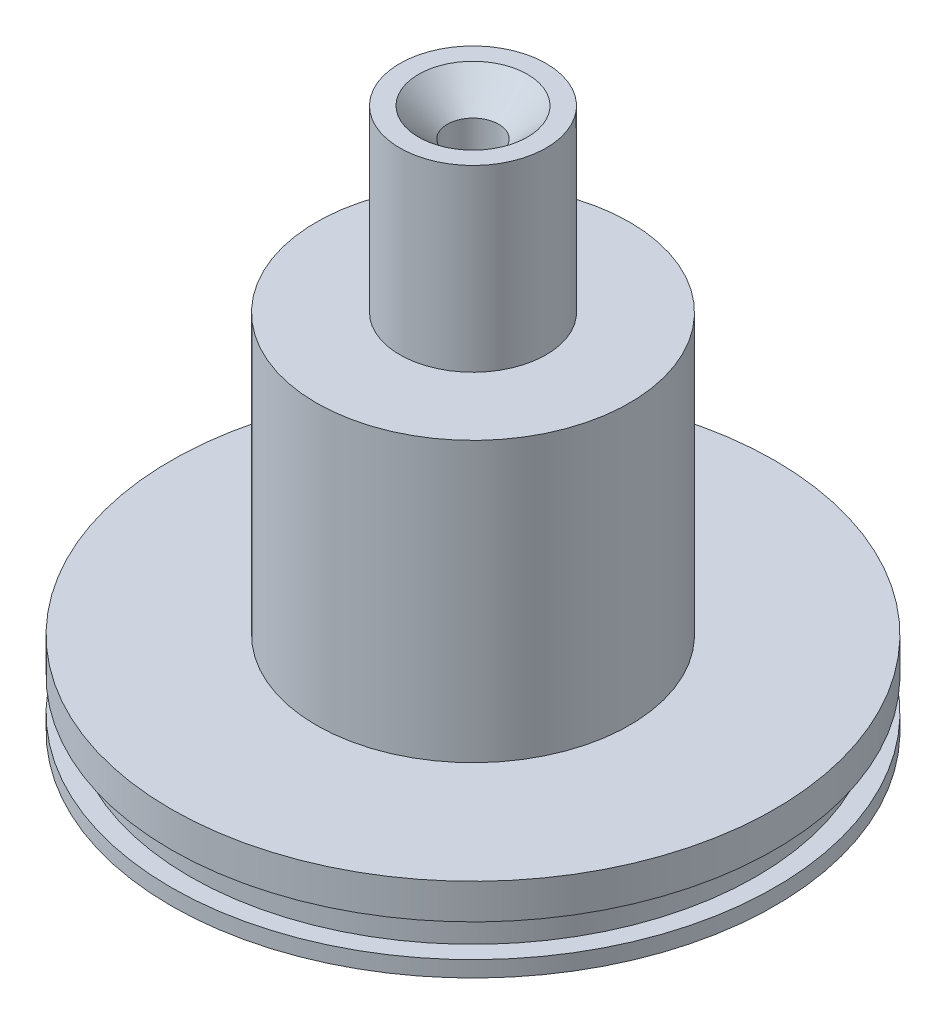
ISO-10303-21;
HEADER;
FILE_DESCRIPTION(('STEP AP214'),'2;1');
FILE_NAME('part.step','',(''),(''),'','','');
FILE_SCHEMA(('AUTOMOTIVE_DESIGN { 1 0 10303 214 1 1 1 1 }'));
ENDSEC;
DATA;
#1=APPLICATION_CONTEXT('core data for automotive mechanical design processes');
#2=APPLICATION_PROTOCOL_DEFINITION('international standard','automotive_design',2000,#1);
#3=PRODUCT_CONTEXT('',#1,'mechanical');
#4=PRODUCT('Part','Part','',(#3));
#5=PRODUCT_RELATED_PRODUCT_CATEGORY('part','',(#4));
#6=PRODUCT_DEFINITION_FORMATION('','',#4);
#7=PRODUCT_DEFINITION_CONTEXT('part definition',#1,'design');
#8=PRODUCT_DEFINITION('design','',#6,#7);
#9=PRODUCT_DEFINITION_SHAPE('','',#8);
#10=(LENGTH_UNIT() NAMED_UNIT(*) SI_UNIT(.MILLI.,.METRE.));
#11=(NAMED_UNIT(*) PLANE_ANGLE_UNIT() SI_UNIT($,.RADIAN.));
#12=(NAMED_UNIT(*) SI_UNIT($,.STERADIAN.) SOLID_ANGLE_UNIT());
#13=UNCERTAINTY_MEASURE_WITH_UNIT(LENGTH_MEASURE(1.E-05),#10,'distance_accuracy_value','');
#14=(GEOMETRIC_REPRESENTATION_CONTEXT(3) GLOBAL_UNCERTAINTY_ASSIGNED_CONTEXT((#13)) GLOBAL_UNIT_ASSIGNED_CONTEXT((#10,
#11,#12)) REPRESENTATION_CONTEXT('',''));
#15=CARTESIAN_POINT('',(0.,0.,0.));
#16=DIRECTION('',(0.,0.,1.));
#17=DIRECTION('',(1.,0.,0.));
#18=AXIS2_PLACEMENT_3D('',#15,#16,#17);
#19=CARTESIAN_POINT('',(45.7708,0.,0.));
#20=DIRECTION('',(0.,-1.,0.));
#21=DIRECTION('',(0.,0.,-1.));
#22=AXIS2_PLACEMENT_3D('',#19,#20,#21);
#23=PLANE('',#22);
#24=CARTESIAN_POINT('',(0.,0.,0.));
#25=DIRECTION('',(0.,-1.,0.));
#26=DIRECTION('',(0.,0.,-1.));
#27=AXIS2_PLACEMENT_3D('',#24,#25,#26);
#28=CIRCLE('',#27,45.7708);
#29=CARTESIAN_POINT('',(0.,0.,-45.7708));
#30=VERTEX_POINT('',#29);
#31=EDGE_CURVE('E81',#30,#30,#28,.T.);
#32=ORIENTED_EDGE('',*,*,#31,.T.);
#33=EDGE_LOOP('',(#32));
#34=FACE_BOUND('',#33,.T.);
#35=CARTESIAN_POINT('',(0.,0.,0.));
#36=DIRECTION('',(0.,-1.,0.));
#37=DIRECTION('',(0.,0.,-1.));
#38=AXIS2_PLACEMENT_3D('',#35,#36,#37);
#39=CIRCLE('',#38,19.1516);
#40=CARTESIAN_POINT('',(0.,0.,-19.1516));
#41=VERTEX_POINT('',#40);
#42=EDGE_CURVE('E10',#41,#41,#39,.T.);
#43=ORIENTED_EDGE('',*,*,#42,.F.);
#44=EDGE_LOOP('',(#43));
#45=FACE_BOUND('',#44,.T.);
#46=ADVANCED_FACE('F32',(#34,#45),#23,.T.);
#47=CARTESIAN_POINT('',(0.,50.8,0.));
#48=DIRECTION('',(0.,-1.,0.));
#49=DIRECTION('',(0.,0.,-1.));
#50=AXIS2_PLACEMENT_3D('',#47,#48,#49);
#51=CYLINDRICAL_SURFACE('',#50,19.1516);
#52=ORIENTED_EDGE('',*,*,#42,.T.);
#53=EDGE_LOOP('',(#52));
#54=FACE_BOUND('',#53,.T.);
#55=CARTESIAN_POINT('',(0.,50.8,0.));
#56=DIRECTION('',(0.,-1.,0.));
#57=DIRECTION('',(0.,0.,-1.));
#58=AXIS2_PLACEMENT_3D('',#55,#56,#57);
#59=CIRCLE('',#58,19.1516);
#60=CARTESIAN_POINT('',(0.,50.8,-19.1516));
#61=VERTEX_POINT('',#60);
#62=EDGE_CURVE('E38',#61,#61,#59,.T.);
#63=ORIENTED_EDGE('',*,*,#62,.F.);
#64=EDGE_LOOP('',(#63));
#65=FACE_BOUND('',#64,.T.);
#66=ADVANCED_FACE('F99',(#54,#65),#51,.F.);
#67=CARTESIAN_POINT('',(19.1516,50.8,0.));
#68=DIRECTION('',(0.,-1.,0.));
#69=DIRECTION('',(0.,0.,-1.));
#70=AXIS2_PLACEMENT_3D('',#67,#68,#69);
#71=PLANE('',#70);
#72=ORIENTED_EDGE('',*,*,#62,.T.);
#73=EDGE_LOOP('',(#72));
#74=FACE_BOUND('',#73,.T.);
#75=ADVANCED_FACE('F103',(#74),#71,.T.);
#76=CARTESIAN_POINT('',(0.,55.0164,0.));
#77=DIRECTION('',(0.,1.,0.));
#78=DIRECTION('',(0.,0.,1.));
#79=AXIS2_PLACEMENT_3D('',#76,#77,#78);
#80=PLANE('',#79);
#81=CARTESIAN_POINT('',(0.,55.0164,0.));
#82=DIRECTION('',(0.,-1.,0.));
#83=DIRECTION('',(0.,0.,-1.));
#84=AXIS2_PLACEMENT_3D('',#81,#82,#83);
#85=CIRCLE('',#84,3.8862);
#86=CARTESIAN_POINT('',(0.,55.0164,-3.8862));
#87=VERTEX_POINT('',#86);
#88=EDGE_CURVE('E42',#87,#87,#85,.T.);
#89=ORIENTED_EDGE('',*,*,#88,.F.);
#90=EDGE_LOOP('',(#89));
#91=FACE_BOUND('',#90,.T.);
#92=ADVANCED_FACE('F107',(#91),#80,.T.);
#93=CARTESIAN_POINT('',(0.,50.8,0.));
#94=DIRECTION('',(0.,-1.,0.));
#95=DIRECTION('',(0.,0.,-1.));
#96=AXIS2_PLACEMENT_3D('',#93,#94,#95);
#97=CYLINDRICAL_SURFACE('',#96,3.8862);
#98=ORIENTED_EDGE('',*,*,#88,.T.);
#99=EDGE_LOOP('',(#98));
#100=FACE_BOUND('',#99,.T.);
#101=CARTESIAN_POINT('',(0.,77.8002,0.));
#102=DIRECTION('',(0.,-1.,0.));
#103=DIRECTION('',(0.,0.,-1.));
#104=AXIS2_PLACEMENT_3D('',#101,#102,#103);
#105=CIRCLE('',#104,3.8862);
#106=CARTESIAN_POINT('',(0.,77.8002,-3.8862));
#107=VERTEX_POINT('',#106);
#108=EDGE_CURVE('E46',#107,#107,#105,.T.);
#109=ORIENTED_EDGE('',*,*,#108,.F.);
#110=EDGE_LOOP('',(#109));
#111=FACE_BOUND('',#110,.T.);
#112=ADVANCED_FACE('F113',(#100,#111),#97,.F.);
#113=CARTESIAN_POINT('',(0.,82.169,0.));
#114=DIRECTION('',(0.,1.,0.));
#115=DIRECTION('',(0.,0.,1.));
#116=AXIS2_PLACEMENT_3D('',#113,#114,#115);
#117=CONICAL_SURFACE('',#116,8.25500000000001,0.78539816339745);
#118=ORIENTED_EDGE('',*,*,#108,.T.);
#119=EDGE_LOOP('',(#118));
#120=FACE_BOUND('',#119,.T.);
#121=CARTESIAN_POINT('',(0.,82.169,0.));
#122=DIRECTION('',(0.,-1.,0.));
#123=DIRECTION('',(0.,0.,-1.));
#124=AXIS2_PLACEMENT_3D('',#121,#122,#123);
#125=CIRCLE('',#124,8.25500000000001);
#126=CARTESIAN_POINT('',(0.,82.169,-8.25500000000001));
#127=VERTEX_POINT('',#126);
#128=EDGE_CURVE('E51',#127,#127,#125,.T.);
#129=ORIENTED_EDGE('',*,*,#128,.F.);
#130=EDGE_LOOP('',(#129));
#131=FACE_BOUND('',#130,.T.);
#132=ADVANCED_FACE('F117',(#120,#131),#117,.F.);
#133=CARTESIAN_POINT('',(8.25500000000001,82.169,0.));
#134=DIRECTION('',(0.,1.,0.));
#135=DIRECTION('',(0.,0.,1.));
#136=AXIS2_PLACEMENT_3D('',#133,#134,#135);
#137=PLANE('',#136);
#138=ORIENTED_EDGE('',*,*,#128,.T.);
#139=EDGE_LOOP('',(#138));
#140=FACE_BOUND('',#139,.T.);
#141=CARTESIAN_POINT('',(0.,82.169,0.));
#142=DIRECTION('',(0.,-1.,0.));
#143=DIRECTION('',(0.,0.,-1.));
#144=AXIS2_PLACEMENT_3D('',#141,#142,#143);
#145=CIRCLE('',#144,11.0998);
#146=CARTESIAN_POINT('',(0.,82.169,-11.0998));
#147=VERTEX_POINT('',#146);
#148=EDGE_CURVE('E54',#147,#147,#145,.T.);
#149=ORIENTED_EDGE('',*,*,#148,.F.);
#150=EDGE_LOOP('',(#149));
#151=FACE_BOUND('',#150,.T.);
#152=ADVANCED_FACE('F121',(#140,#151),#137,.T.);
#153=CARTESIAN_POINT('',(0.,50.8,0.));
#154=DIRECTION('',(0.,-1.,0.));
#155=DIRECTION('',(0.,0.,-1.));
#156=AXIS2_PLACEMENT_3D('',#153,#154,#155);
#157=CYLINDRICAL_SURFACE('',#156,11.0998);
#158=ORIENTED_EDGE('',*,*,#148,.T.);
#159=EDGE_LOOP('',(#158));
#160=FACE_BOUND('',#159,.T.);
#161=CARTESIAN_POINT('',(0.,55.0164,0.));
#162=DIRECTION('',(0.,-1.,0.));
#163=DIRECTION('',(0.,0.,-1.));
#164=AXIS2_PLACEMENT_3D('',#161,#162,#163);
#165=CIRCLE('',#164,11.0998);
#166=CARTESIAN_POINT('',(0.,55.0164,-11.0998));
#167=VERTEX_POINT('',#166);
#168=EDGE_CURVE('E57',#167,#167,#165,.T.);
#169=ORIENTED_EDGE('',*,*,#168,.F.);
#170=EDGE_LOOP('',(#169));
#171=FACE_BOUND('',#170,.T.);
#172=ADVANCED_FACE('F125',(#160,#171),#157,.T.);
#173=CARTESIAN_POINT('',(11.0998,55.0164,0.));
#174=DIRECTION('',(0.,1.,0.));
#175=DIRECTION('',(0.,0.,1.));
#176=AXIS2_PLACEMENT_3D('',#173,#174,#175);
#177=PLANE('',#176);
#178=ORIENTED_EDGE('',*,*,#168,.T.);
#179=EDGE_LOOP('',(#178));
#180=FACE_BOUND('',#179,.T.);
#181=CARTESIAN_POINT('',(0.,55.0164,0.));
#182=DIRECTION('',(0.,-1.,0.));
#183=DIRECTION('',(0.,0.,-1.));
#184=AXIS2_PLACEMENT_3D('',#181,#182,#183);
#185=CIRCLE('',#184,23.749);
#186=CARTESIAN_POINT('',(0.,55.0164,-23.749));
#187=VERTEX_POINT('',#186);
#188=EDGE_CURVE('E60',#187,#187,#185,.T.);
#189=ORIENTED_EDGE('',*,*,#188,.F.);
#190=EDGE_LOOP('',(#189));
#191=FACE_BOUND('',#190,.T.);
#192=ADVANCED_FACE('F129',(#180,#191),#177,.T.);
#193=CARTESIAN_POINT('',(0.,50.8,0.));
#194=DIRECTION('',(0.,-1.,0.));
#195=DIRECTION('',(0.,0.,-1.));
#196=AXIS2_PLACEMENT_3D('',#193,#194,#195);
#197=CYLINDRICAL_SURFACE('',#196,23.749);
#198=ORIENTED_EDGE('',*,*,#188,.T.);
#199=EDGE_LOOP('',(#198));
#200=FACE_BOUND('',#199,.T.);
#201=CARTESIAN_POINT('',(0.,12.7,0.));
#202=DIRECTION('',(0.,-1.,0.));
#203=DIRECTION('',(0.,0.,-1.));
#204=AXIS2_PLACEMENT_3D('',#201,#202,#203);
#205=CIRCLE('',#204,23.749);
#206=CARTESIAN_POINT('',(0.,12.7,-23.749));
#207=VERTEX_POINT('',#206);
#208=EDGE_CURVE('E63',#207,#207,#205,.T.);
#209=ORIENTED_EDGE('',*,*,#208,.F.);
#210=EDGE_LOOP('',(#209));
#211=FACE_BOUND('',#210,.T.);
#212=ADVANCED_FACE('F133',(#200,#211),#197,.T.);
#213=CARTESIAN_POINT('',(23.749,12.7,0.));
#214=DIRECTION('',(0.,1.,0.));
#215=DIRECTION('',(0.,0.,1.));
#216=AXIS2_PLACEMENT_3D('',#213,#214,#215);
#217=PLANE('',#216);
#218=ORIENTED_EDGE('',*,*,#208,.T.);
#219=EDGE_LOOP('',(#218));
#220=FACE_BOUND('',#219,.T.);
#221=CARTESIAN_POINT('',(0.,12.7,0.));
#222=DIRECTION('',(0.,-1.,0.));
#223=DIRECTION('',(0.,0.,-1.));
#224=AXIS2_PLACEMENT_3D('',#221,#222,#223);
#225=CIRCLE('',#224,45.7708);
#226=CARTESIAN_POINT('',(0.,12.7,-45.7708));
#227=VERTEX_POINT('',#226);
#228=EDGE_CURVE('E66',#227,#227,#225,.T.);
#229=ORIENTED_EDGE('',*,*,#228,.F.);
#230=EDGE_LOOP('',(#229));
#231=FACE_BOUND('',#230,.T.);
#232=ADVANCED_FACE('F137',(#220,#231),#217,.T.);
#233=CARTESIAN_POINT('',(0.,50.8,0.));
#234=DIRECTION('',(0.,-1.,0.));
#235=DIRECTION('',(0.,0.,-1.));
#236=AXIS2_PLACEMENT_3D('',#233,#234,#235);
#237=CYLINDRICAL_SURFACE('',#236,45.7708);
#238=ORIENTED_EDGE('',*,*,#228,.T.);
#239=EDGE_LOOP('',(#238));
#240=FACE_BOUND('',#239,.T.);
#241=CARTESIAN_POINT('',(0.,7.36599999999999,0.));
#242=DIRECTION('',(0.,-1.,0.));
#243=DIRECTION('',(0.,0.,-1.));
#244=AXIS2_PLACEMENT_3D('',#241,#242,#243);
#245=CIRCLE('',#244,45.7708);
#246=CARTESIAN_POINT('',(0.,7.36599999999999,-45.7708));
#247=VERTEX_POINT('',#246);
#248=EDGE_CURVE('E69',#247,#247,#245,.T.);
#249=ORIENTED_EDGE('',*,*,#248,.F.);
#250=EDGE_LOOP('',(#249));
#251=FACE_BOUND('',#250,.T.);
#252=ADVANCED_FACE('F141',(#240,#251),#237,.T.);
#253=CARTESIAN_POINT('',(45.7708,7.366,0.));
#254=DIRECTION('',(0.,-1.,0.));
#255=DIRECTION('',(0.,0.,-1.));
#256=AXIS2_PLACEMENT_3D('',#253,#254,#255);
#257=PLANE('',#256);
#258=ORIENTED_EDGE('',*,*,#248,.T.);
#259=EDGE_LOOP('',(#258));
#260=FACE_BOUND('',#259,.T.);
#261=CARTESIAN_POINT('',(0.,7.366,0.));
#262=DIRECTION('',(0.,-1.,0.));
#263=DIRECTION('',(0.,0.,-1.));
#264=AXIS2_PLACEMENT_3D('',#261,#262,#263);
#265=CIRCLE('',#264,42.926);
#266=CARTESIAN_POINT('',(0.,7.366,-42.926));
#267=VERTEX_POINT('',#266);
#268=EDGE_CURVE('E72',#267,#267,#265,.T.);
#269=ORIENTED_EDGE('',*,*,#268,.F.);
#270=EDGE_LOOP('',(#269));
#271=FACE_BOUND('',#270,.T.);
#272=ADVANCED_FACE('F145',(#260,#271),#257,.T.);
#273=CARTESIAN_POINT('',(0.,50.8,0.));
#274=DIRECTION('',(0.,-1.,0.));
#275=DIRECTION('',(0.,0.,-1.));
#276=AXIS2_PLACEMENT_3D('',#273,#274,#275);
#277=CYLINDRICAL_SURFACE('',#276,42.926);
#278=ORIENTED_EDGE('',*,*,#268,.T.);
#279=EDGE_LOOP('',(#278));
#280=FACE_BOUND('',#279,.T.);
#281=CARTESIAN_POINT('',(0.,2.413,0.));
#282=DIRECTION('',(0.,-1.,0.));
#283=DIRECTION('',(0.,0.,-1.));
#284=AXIS2_PLACEMENT_3D('',#281,#282,#283);
#285=CIRCLE('',#284,42.926);
#286=CARTESIAN_POINT('',(0.,2.413,-42.926));
#287=VERTEX_POINT('',#286);
#288=EDGE_CURVE('E75',#287,#287,#285,.T.);
#289=ORIENTED_EDGE('',*,*,#288,.F.);
#290=EDGE_LOOP('',(#289));
#291=FACE_BOUND('',#290,.T.);
#292=ADVANCED_FACE('F95',(#280,#291),#277,.T.);
#293=CARTESIAN_POINT('',(42.926,2.413,0.));
#294=DIRECTION('',(0.,1.,0.));
#295=DIRECTION('',(0.,0.,1.));
#296=AXIS2_PLACEMENT_3D('',#293,#294,#295);
#297=PLANE('',#296);
#298=ORIENTED_EDGE('',*,*,#288,.T.);
#299=EDGE_LOOP('',(#298));
#300=FACE_BOUND('',#299,.T.);
#301=CARTESIAN_POINT('',(0.,2.413,0.));
#302=DIRECTION('',(0.,-1.,0.));
#303=DIRECTION('',(0.,0.,-1.));
#304=AXIS2_PLACEMENT_3D('',#301,#302,#303);
#305=CIRCLE('',#304,45.7708);
#306=CARTESIAN_POINT('',(0.,2.413,-45.7708));
#307=VERTEX_POINT('',#306);
#308=EDGE_CURVE('E78',#307,#307,#305,.T.);
#309=ORIENTED_EDGE('',*,*,#308,.F.);
#310=EDGE_LOOP('',(#309));
#311=FACE_BOUND('',#310,.T.);
#312=ADVANCED_FACE('F89',(#300,#311),#297,.T.);
#313=CARTESIAN_POINT('',(0.,50.8,0.));
#314=DIRECTION('',(0.,-1.,0.));
#315=DIRECTION('',(0.,0.,-1.));
#316=AXIS2_PLACEMENT_3D('',#313,#314,#315);
#317=CYLINDRICAL_SURFACE('',#316,45.7708);
#318=ORIENTED_EDGE('',*,*,#308,.T.);
#319=EDGE_LOOP('',(#318));
#320=FACE_BOUND('',#319,.T.);
#321=ORIENTED_EDGE('',*,*,#31,.F.);
#322=EDGE_LOOP('',(#321));
#323=FACE_BOUND('',#322,.T.);
#324=ADVANCED_FACE('F87',(#320,#323),#317,.T.);
#325=CLOSED_SHELL('',(#46,#66,#75,#92,#112,#132,#152,#172,#192,#212,#232,#252,#272,#292,#312,#324));
#326=MANIFOLD_SOLID_BREP('B2',#325);
#327=ADVANCED_BREP_SHAPE_REPRESENTATION('',(#18,#326),#14);
#328=SHAPE_DEFINITION_REPRESENTATION(#9,#327);
ENDSEC;
END-ISO-10303-21;
